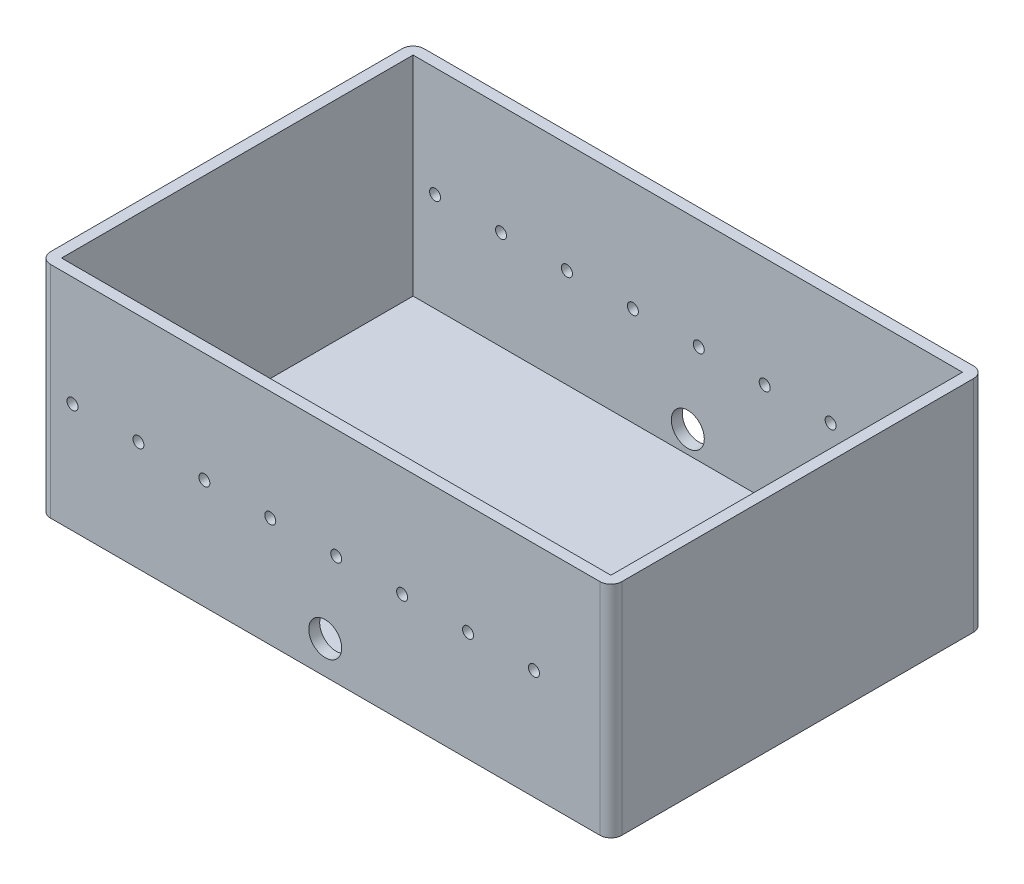
ISO-10303-21;
HEADER;
FILE_DESCRIPTION(('STEP AP214'),'2;1');
FILE_NAME('part.step','',(''),(''),'','','');
FILE_SCHEMA(('AUTOMOTIVE_DESIGN { 1 0 10303 214 1 1 1 1 }'));
ENDSEC;
DATA;
#1=APPLICATION_CONTEXT('core data for automotive mechanical design processes');
#2=APPLICATION_PROTOCOL_DEFINITION('international standard','automotive_design',2000,#1);
#3=PRODUCT_CONTEXT('',#1,'mechanical');
#4=PRODUCT('Part','Part','',(#3));
#5=PRODUCT_RELATED_PRODUCT_CATEGORY('part','',(#4));
#6=PRODUCT_DEFINITION_FORMATION('','',#4);
#7=PRODUCT_DEFINITION_CONTEXT('part definition',#1,'design');
#8=PRODUCT_DEFINITION('design','',#6,#7);
#9=PRODUCT_DEFINITION_SHAPE('','',#8);
#10=(LENGTH_UNIT() NAMED_UNIT(*) SI_UNIT(.MILLI.,.METRE.));
#11=(NAMED_UNIT(*) PLANE_ANGLE_UNIT() SI_UNIT($,.RADIAN.));
#12=(NAMED_UNIT(*) SI_UNIT($,.STERADIAN.) SOLID_ANGLE_UNIT());
#13=UNCERTAINTY_MEASURE_WITH_UNIT(LENGTH_MEASURE(1.E-05),#10,'distance_accuracy_value','');
#14=(GEOMETRIC_REPRESENTATION_CONTEXT(3) GLOBAL_UNCERTAINTY_ASSIGNED_CONTEXT((#13)) GLOBAL_UNIT_ASSIGNED_CONTEXT((#10,
#11,#12)) REPRESENTATION_CONTEXT('',''));
#15=CARTESIAN_POINT('',(0.,0.,0.));
#16=DIRECTION('',(0.,0.,1.));
#17=DIRECTION('',(1.,0.,0.));
#18=AXIS2_PLACEMENT_3D('',#15,#16,#17);
#19=CARTESIAN_POINT('',(130.,100.,0.));
#20=DIRECTION('',(0.,1.,0.));
#21=DIRECTION('',(0.,0.,1.));
#22=AXIS2_PLACEMENT_3D('',#19,#20,#21);
#23=PLANE('',#22);
#24=DIRECTION('',(-1.,0.,0.));
#25=VECTOR('',#24,1.);
#26=CARTESIAN_POINT('',(130.,100.,0.));
#27=LINE('',#26,#25);
#28=CARTESIAN_POINT('',(125.,100.,0.));
#29=VERTEX_POINT('',#28);
#30=CARTESIAN_POINT('',(-125.,100.,0.));
#31=VERTEX_POINT('',#30);
#32=EDGE_CURVE('E180',#29,#31,#27,.T.);
#33=ORIENTED_EDGE('',*,*,#32,.T.);
#34=CARTESIAN_POINT('',(-125.,100.,5.));
#35=DIRECTION('',(0.,1.,0.));
#36=DIRECTION('',(0.,0.,1.));
#37=AXIS2_PLACEMENT_3D('',#34,#35,#36);
#38=CIRCLE('',#37,5.);
#39=CARTESIAN_POINT('',(-130.,100.,5.));
#40=VERTEX_POINT('',#39);
#41=EDGE_CURVE('E220',#31,#40,#38,.T.);
#42=ORIENTED_EDGE('',*,*,#41,.T.);
#43=DIRECTION('',(0.,0.,-1.));
#44=VECTOR('',#43,1.);
#45=CARTESIAN_POINT('',(-130.,100.,0.));
#46=LINE('',#45,#44);
#47=CARTESIAN_POINT('',(-130.,100.,165.));
#48=VERTEX_POINT('',#47);
#49=EDGE_CURVE('E170',#48,#40,#46,.T.);
#50=ORIENTED_EDGE('',*,*,#49,.F.);
#51=CARTESIAN_POINT('',(-125.,100.,165.));
#52=DIRECTION('',(0.,1.,0.));
#53=DIRECTION('',(0.,0.,1.));
#54=AXIS2_PLACEMENT_3D('',#51,#52,#53);
#55=CIRCLE('',#54,5.);
#56=CARTESIAN_POINT('',(-125.,100.,170.));
#57=VERTEX_POINT('',#56);
#58=EDGE_CURVE('E216',#48,#57,#55,.T.);
#59=ORIENTED_EDGE('',*,*,#58,.T.);
#60=DIRECTION('',(-1.,0.,0.));
#61=VECTOR('',#60,1.);
#62=CARTESIAN_POINT('',(130.,100.,170.));
#63=LINE('',#62,#61);
#64=CARTESIAN_POINT('',(125.,100.,170.));
#65=VERTEX_POINT('',#64);
#66=EDGE_CURVE('E193',#65,#57,#63,.T.);
#67=ORIENTED_EDGE('',*,*,#66,.F.);
#68=CARTESIAN_POINT('',(125.,100.,165.));
#69=DIRECTION('',(0.,1.,0.));
#70=DIRECTION('',(0.,0.,1.));
#71=AXIS2_PLACEMENT_3D('',#68,#69,#70);
#72=CIRCLE('',#71,5.);
#73=CARTESIAN_POINT('',(130.,100.,165.));
#74=VERTEX_POINT('',#73);
#75=EDGE_CURVE('E62',#65,#74,#72,.T.);
#76=ORIENTED_EDGE('',*,*,#75,.T.);
#77=DIRECTION('',(0.,0.,-1.));
#78=VECTOR('',#77,1.);
#79=CARTESIAN_POINT('',(130.,100.,0.));
#80=LINE('',#79,#78);
#81=CARTESIAN_POINT('',(130.,100.,5.));
#82=VERTEX_POINT('',#81);
#83=EDGE_CURVE('E174',#74,#82,#80,.T.);
#84=ORIENTED_EDGE('',*,*,#83,.T.);
#85=CARTESIAN_POINT('',(125.,100.,5.));
#86=DIRECTION('',(0.,1.,0.));
#87=DIRECTION('',(0.,0.,1.));
#88=AXIS2_PLACEMENT_3D('',#85,#86,#87);
#89=CIRCLE('',#88,5.);
#90=EDGE_CURVE('E218',#82,#29,#89,.T.);
#91=ORIENTED_EDGE('',*,*,#90,.T.);
#92=EDGE_LOOP('',(#33,#42,#50,#59,#67,#76,#84,#91));
#93=FACE_BOUND('',#92,.T.);
#94=DIRECTION('',(1.,0.,0.));
#95=VECTOR('',#94,1.);
#96=CARTESIAN_POINT('',(-125.,100.,165.));
#97=LINE('',#96,#95);
#98=CARTESIAN_POINT('',(-125.,100.,165.));
#99=VERTEX_POINT('',#98);
#100=CARTESIAN_POINT('',(125.,100.,165.));
#101=VERTEX_POINT('',#100);
#102=EDGE_CURVE('E140',#99,#101,#97,.T.);
#103=ORIENTED_EDGE('',*,*,#102,.F.);
#104=DIRECTION('',(0.,0.,1.));
#105=VECTOR('',#104,1.);
#106=CARTESIAN_POINT('',(-125.,100.,0.));
#107=LINE('',#106,#105);
#108=CARTESIAN_POINT('',(-125.,100.,5.));
#109=VERTEX_POINT('',#108);
#110=EDGE_CURVE('E147',#109,#99,#107,.T.);
#111=ORIENTED_EDGE('',*,*,#110,.F.);
#112=DIRECTION('',(1.,0.,0.));
#113=VECTOR('',#112,1.);
#114=CARTESIAN_POINT('',(-125.,100.,5.));
#115=LINE('',#114,#113);
#116=CARTESIAN_POINT('',(125.,100.,5.));
#117=VERTEX_POINT('',#116);
#118=EDGE_CURVE('E130',#109,#117,#115,.T.);
#119=ORIENTED_EDGE('',*,*,#118,.T.);
#120=DIRECTION('',(0.,0.,1.));
#121=VECTOR('',#120,1.);
#122=CARTESIAN_POINT('',(125.,100.,0.));
#123=LINE('',#122,#121);
#124=EDGE_CURVE('E160',#117,#101,#123,.T.);
#125=ORIENTED_EDGE('',*,*,#124,.T.);
#126=EDGE_LOOP('',(#103,#111,#119,#125));
#127=FACE_BOUND('',#126,.T.);
#128=ADVANCED_FACE('F38',(#93,#127),#23,.T.);
#129=CARTESIAN_POINT('',(130.,0.,170.));
#130=DIRECTION('',(0.,0.,1.));
#131=DIRECTION('',(1.,0.,0.));
#132=AXIS2_PLACEMENT_3D('',#129,#130,#131);
#133=PLANE('',#132);
#134=CARTESIAN_POINT('',(0.,15.,170.));
#135=DIRECTION('',(0.,0.,1.));
#136=DIRECTION('',(1.,0.,0.));
#137=AXIS2_PLACEMENT_3D('',#134,#135,#136);
#138=CIRCLE('',#137,7.5);
#139=CARTESIAN_POINT('',(7.5,15.,170.));
#140=VERTEX_POINT('',#139);
#141=EDGE_CURVE('E327',#140,#140,#138,.T.);
#142=ORIENTED_EDGE('',*,*,#141,.F.);
#143=EDGE_LOOP('',(#142));
#144=FACE_BOUND('',#143,.T.);
#145=CARTESIAN_POINT('',(95.,50.,170.));
#146=DIRECTION('',(0.,0.,1.));
#147=DIRECTION('',(1.,0.,0.));
#148=AXIS2_PLACEMENT_3D('',#145,#146,#147);
#149=CIRCLE('',#148,2.5);
#150=CARTESIAN_POINT('',(97.5,50.,170.));
#151=VERTEX_POINT('',#150);
#152=EDGE_CURVE('E320',#151,#151,#149,.T.);
#153=ORIENTED_EDGE('',*,*,#152,.F.);
#154=EDGE_LOOP('',(#153));
#155=FACE_BOUND('',#154,.T.);
#156=CARTESIAN_POINT('',(65.,49.9999999999998,170.));
#157=DIRECTION('',(0.,0.,1.));
#158=DIRECTION('',(1.,0.,0.));
#159=AXIS2_PLACEMENT_3D('',#156,#157,#158);
#160=CIRCLE('',#159,2.5);
#161=CARTESIAN_POINT('',(67.5,49.9999999999998,170.));
#162=VERTEX_POINT('',#161);
#163=EDGE_CURVE('E314',#162,#162,#160,.T.);
#164=ORIENTED_EDGE('',*,*,#163,.F.);
#165=EDGE_LOOP('',(#164));
#166=FACE_BOUND('',#165,.T.);
#167=CARTESIAN_POINT('',(35.,49.9999999999996,170.));
#168=DIRECTION('',(0.,0.,1.));
#169=DIRECTION('',(1.,0.,0.));
#170=AXIS2_PLACEMENT_3D('',#167,#168,#169);
#171=CIRCLE('',#170,2.5);
#172=CARTESIAN_POINT('',(37.5,49.9999999999996,170.));
#173=VERTEX_POINT('',#172);
#174=EDGE_CURVE('E308',#173,#173,#171,.T.);
#175=ORIENTED_EDGE('',*,*,#174,.F.);
#176=EDGE_LOOP('',(#175));
#177=FACE_BOUND('',#176,.T.);
#178=CARTESIAN_POINT('',(5.,49.9999999999994,170.));
#179=DIRECTION('',(0.,0.,1.));
#180=DIRECTION('',(1.,0.,0.));
#181=AXIS2_PLACEMENT_3D('',#178,#179,#180);
#182=CIRCLE('',#181,2.5);
#183=CARTESIAN_POINT('',(7.5,49.9999999999994,170.));
#184=VERTEX_POINT('',#183);
#185=EDGE_CURVE('E302',#184,#184,#182,.T.);
#186=ORIENTED_EDGE('',*,*,#185,.F.);
#187=EDGE_LOOP('',(#186));
#188=FACE_BOUND('',#187,.T.);
#189=CARTESIAN_POINT('',(-25.,49.9999999999991,170.));
#190=DIRECTION('',(0.,0.,1.));
#191=DIRECTION('',(1.,0.,0.));
#192=AXIS2_PLACEMENT_3D('',#189,#190,#191);
#193=CIRCLE('',#192,2.5);
#194=CARTESIAN_POINT('',(-22.5,49.9999999999991,170.));
#195=VERTEX_POINT('',#194);
#196=EDGE_CURVE('E296',#195,#195,#193,.T.);
#197=ORIENTED_EDGE('',*,*,#196,.F.);
#198=EDGE_LOOP('',(#197));
#199=FACE_BOUND('',#198,.T.);
#200=CARTESIAN_POINT('',(-55.,49.9999999999989,170.));
#201=DIRECTION('',(0.,0.,1.));
#202=DIRECTION('',(1.,0.,0.));
#203=AXIS2_PLACEMENT_3D('',#200,#201,#202);
#204=CIRCLE('',#203,2.5);
#205=CARTESIAN_POINT('',(-52.5,49.9999999999989,170.));
#206=VERTEX_POINT('',#205);
#207=EDGE_CURVE('E290',#206,#206,#204,.T.);
#208=ORIENTED_EDGE('',*,*,#207,.F.);
#209=EDGE_LOOP('',(#208));
#210=FACE_BOUND('',#209,.T.);
#211=CARTESIAN_POINT('',(-85.,49.9999999999987,170.));
#212=DIRECTION('',(0.,0.,1.));
#213=DIRECTION('',(1.,0.,0.));
#214=AXIS2_PLACEMENT_3D('',#211,#212,#213);
#215=CIRCLE('',#214,2.5);
#216=CARTESIAN_POINT('',(-82.5,49.9999999999987,170.));
#217=VERTEX_POINT('',#216);
#218=EDGE_CURVE('E284',#217,#217,#215,.T.);
#219=ORIENTED_EDGE('',*,*,#218,.F.);
#220=EDGE_LOOP('',(#219));
#221=FACE_BOUND('',#220,.T.);
#222=CARTESIAN_POINT('',(-115.,49.9999999999985,170.));
#223=DIRECTION('',(0.,0.,1.));
#224=DIRECTION('',(1.,0.,0.));
#225=AXIS2_PLACEMENT_3D('',#222,#223,#224);
#226=CIRCLE('',#225,2.5);
#227=CARTESIAN_POINT('',(-112.5,49.9999999999985,170.));
#228=VERTEX_POINT('',#227);
#229=EDGE_CURVE('E277',#228,#228,#226,.T.);
#230=ORIENTED_EDGE('',*,*,#229,.F.);
#231=EDGE_LOOP('',(#230));
#232=FACE_BOUND('',#231,.T.);
#233=ORIENTED_EDGE('',*,*,#66,.T.);
#234=DIRECTION('',(0.,1.,0.));
#235=VECTOR('',#234,1.);
#236=CARTESIAN_POINT('',(-125.,0.,170.));
#237=LINE('',#236,#235);
#238=CARTESIAN_POINT('',(-125.,0.,170.));
#239=VERTEX_POINT('',#238);
#240=EDGE_CURVE('E11',#57,#239,#237,.F.);
#241=ORIENTED_EDGE('',*,*,#240,.T.);
#242=DIRECTION('',(-1.,0.,0.));
#243=VECTOR('',#242,1.);
#244=CARTESIAN_POINT('',(130.,0.,170.));
#245=LINE('',#244,#243);
#246=CARTESIAN_POINT('',(125.,0.,170.));
#247=VERTEX_POINT('',#246);
#248=EDGE_CURVE('E190',#247,#239,#245,.T.);
#249=ORIENTED_EDGE('',*,*,#248,.F.);
#250=DIRECTION('',(0.,1.,0.));
#251=VECTOR('',#250,1.);
#252=CARTESIAN_POINT('',(125.,0.,170.));
#253=LINE('',#252,#251);
#254=EDGE_CURVE('E47',#247,#65,#253,.T.);
#255=ORIENTED_EDGE('',*,*,#254,.T.);
#256=EDGE_LOOP('',(#233,#241,#249,#255));
#257=FACE_BOUND('',#256,.T.);
#258=ADVANCED_FACE('F355',(#144,#155,#166,#177,#188,#199,#210,#221,#232,#257),#133,.T.);
#259=CARTESIAN_POINT('',(130.,0.,0.));
#260=DIRECTION('',(0.,-1.,0.));
#261=DIRECTION('',(0.,0.,-1.));
#262=AXIS2_PLACEMENT_3D('',#259,#260,#261);
#263=PLANE('',#262);
#264=DIRECTION('',(0.,0.,1.));
#265=VECTOR('',#264,1.);
#266=CARTESIAN_POINT('',(-130.,0.,0.));
#267=LINE('',#266,#265);
#268=CARTESIAN_POINT('',(-130.,0.,5.));
#269=VERTEX_POINT('',#268);
#270=CARTESIAN_POINT('',(-130.,0.,165.));
#271=VERTEX_POINT('',#270);
#272=EDGE_CURVE('E177',#269,#271,#267,.T.);
#273=ORIENTED_EDGE('',*,*,#272,.F.);
#274=CARTESIAN_POINT('',(-125.,0.,5.));
#275=DIRECTION('',(0.,-1.,0.));
#276=DIRECTION('',(0.,0.,-1.));
#277=AXIS2_PLACEMENT_3D('',#274,#275,#276);
#278=CIRCLE('',#277,5.);
#279=CARTESIAN_POINT('',(-125.,0.,0.));
#280=VERTEX_POINT('',#279);
#281=EDGE_CURVE('E208',#269,#280,#278,.T.);
#282=ORIENTED_EDGE('',*,*,#281,.T.);
#283=DIRECTION('',(-1.,0.,0.));
#284=VECTOR('',#283,1.);
#285=CARTESIAN_POINT('',(130.,0.,0.));
#286=LINE('',#285,#284);
#287=CARTESIAN_POINT('',(125.,0.,0.));
#288=VERTEX_POINT('',#287);
#289=EDGE_CURVE('E187',#288,#280,#286,.T.);
#290=ORIENTED_EDGE('',*,*,#289,.F.);
#291=CARTESIAN_POINT('',(125.,0.,5.));
#292=DIRECTION('',(0.,-1.,0.));
#293=DIRECTION('',(0.,0.,-1.));
#294=AXIS2_PLACEMENT_3D('',#291,#292,#293);
#295=CIRCLE('',#294,5.);
#296=CARTESIAN_POINT('',(130.,0.,5.));
#297=VERTEX_POINT('',#296);
#298=EDGE_CURVE('E206',#288,#297,#295,.T.);
#299=ORIENTED_EDGE('',*,*,#298,.T.);
#300=DIRECTION('',(0.,0.,1.));
#301=VECTOR('',#300,1.);
#302=CARTESIAN_POINT('',(130.,0.,0.));
#303=LINE('',#302,#301);
#304=CARTESIAN_POINT('',(130.,0.,165.));
#305=VERTEX_POINT('',#304);
#306=EDGE_CURVE('E176',#297,#305,#303,.T.);
#307=ORIENTED_EDGE('',*,*,#306,.T.);
#308=CARTESIAN_POINT('',(125.,0.,165.));
#309=DIRECTION('',(0.,-1.,0.));
#310=DIRECTION('',(0.,0.,-1.));
#311=AXIS2_PLACEMENT_3D('',#308,#309,#310);
#312=CIRCLE('',#311,5.);
#313=EDGE_CURVE('E202',#305,#247,#312,.T.);
#314=ORIENTED_EDGE('',*,*,#313,.T.);
#315=ORIENTED_EDGE('',*,*,#248,.T.);
#316=CARTESIAN_POINT('',(-125.,0.,165.));
#317=DIRECTION('',(0.,-1.,0.));
#318=DIRECTION('',(0.,0.,-1.));
#319=AXIS2_PLACEMENT_3D('',#316,#317,#318);
#320=CIRCLE('',#319,5.);
#321=EDGE_CURVE('E204',#239,#271,#320,.T.);
#322=ORIENTED_EDGE('',*,*,#321,.T.);
#323=EDGE_LOOP('',(#273,#282,#290,#299,#307,#314,#315,#322));
#324=FACE_BOUND('',#323,.T.);
#325=ADVANCED_FACE('F360',(#324),#263,.T.);
#326=CARTESIAN_POINT('',(130.,0.,0.));
#327=DIRECTION('',(0.,0.,-1.));
#328=DIRECTION('',(-1.,0.,0.));
#329=AXIS2_PLACEMENT_3D('',#326,#327,#328);
#330=PLANE('',#329);
#331=CARTESIAN_POINT('',(0.,15.,0.));
#332=DIRECTION('',(0.,0.,1.));
#333=DIRECTION('',(1.,0.,0.));
#334=AXIS2_PLACEMENT_3D('',#331,#332,#333);
#335=CIRCLE('',#334,7.5);
#336=CARTESIAN_POINT('',(7.5,15.,0.));
#337=VERTEX_POINT('',#336);
#338=EDGE_CURVE('E330',#337,#337,#335,.T.);
#339=ORIENTED_EDGE('',*,*,#338,.T.);
#340=EDGE_LOOP('',(#339));
#341=FACE_BOUND('',#340,.T.);
#342=CARTESIAN_POINT('',(95.,50.,0.));
#343=DIRECTION('',(0.,0.,1.));
#344=DIRECTION('',(1.,0.,0.));
#345=AXIS2_PLACEMENT_3D('',#342,#343,#344);
#346=CIRCLE('',#345,2.5);
#347=CARTESIAN_POINT('',(97.5,50.,0.));
#348=VERTEX_POINT('',#347);
#349=EDGE_CURVE('E231',#348,#348,#346,.T.);
#350=ORIENTED_EDGE('',*,*,#349,.T.);
#351=EDGE_LOOP('',(#350));
#352=FACE_BOUND('',#351,.T.);
#353=CARTESIAN_POINT('',(65.,49.9999999999998,0.));
#354=DIRECTION('',(0.,0.,1.));
#355=DIRECTION('',(1.,0.,0.));
#356=AXIS2_PLACEMENT_3D('',#353,#354,#355);
#357=CIRCLE('',#356,2.5);
#358=CARTESIAN_POINT('',(67.5,49.9999999999998,0.));
#359=VERTEX_POINT('',#358);
#360=EDGE_CURVE('E317',#359,#359,#357,.T.);
#361=ORIENTED_EDGE('',*,*,#360,.T.);
#362=EDGE_LOOP('',(#361));
#363=FACE_BOUND('',#362,.T.);
#364=CARTESIAN_POINT('',(35.,49.9999999999996,0.));
#365=DIRECTION('',(0.,0.,1.));
#366=DIRECTION('',(1.,0.,0.));
#367=AXIS2_PLACEMENT_3D('',#364,#365,#366);
#368=CIRCLE('',#367,2.5);
#369=CARTESIAN_POINT('',(37.5,49.9999999999996,0.));
#370=VERTEX_POINT('',#369);
#371=EDGE_CURVE('E311',#370,#370,#368,.T.);
#372=ORIENTED_EDGE('',*,*,#371,.T.);
#373=EDGE_LOOP('',(#372));
#374=FACE_BOUND('',#373,.T.);
#375=CARTESIAN_POINT('',(5.,49.9999999999994,0.));
#376=DIRECTION('',(0.,0.,1.));
#377=DIRECTION('',(1.,0.,0.));
#378=AXIS2_PLACEMENT_3D('',#375,#376,#377);
#379=CIRCLE('',#378,2.5);
#380=CARTESIAN_POINT('',(7.5,49.9999999999994,0.));
#381=VERTEX_POINT('',#380);
#382=EDGE_CURVE('E305',#381,#381,#379,.T.);
#383=ORIENTED_EDGE('',*,*,#382,.T.);
#384=EDGE_LOOP('',(#383));
#385=FACE_BOUND('',#384,.T.);
#386=CARTESIAN_POINT('',(-25.,49.9999999999991,0.));
#387=DIRECTION('',(0.,0.,1.));
#388=DIRECTION('',(1.,0.,0.));
#389=AXIS2_PLACEMENT_3D('',#386,#387,#388);
#390=CIRCLE('',#389,2.5);
#391=CARTESIAN_POINT('',(-22.5,49.9999999999991,0.));
#392=VERTEX_POINT('',#391);
#393=EDGE_CURVE('E299',#392,#392,#390,.T.);
#394=ORIENTED_EDGE('',*,*,#393,.T.);
#395=EDGE_LOOP('',(#394));
#396=FACE_BOUND('',#395,.T.);
#397=CARTESIAN_POINT('',(-55.,49.9999999999989,0.));
#398=DIRECTION('',(0.,0.,1.));
#399=DIRECTION('',(1.,0.,0.));
#400=AXIS2_PLACEMENT_3D('',#397,#398,#399);
#401=CIRCLE('',#400,2.5);
#402=CARTESIAN_POINT('',(-52.5,49.9999999999989,0.));
#403=VERTEX_POINT('',#402);
#404=EDGE_CURVE('E293',#403,#403,#401,.T.);
#405=ORIENTED_EDGE('',*,*,#404,.T.);
#406=EDGE_LOOP('',(#405));
#407=FACE_BOUND('',#406,.T.);
#408=CARTESIAN_POINT('',(-85.,49.9999999999987,0.));
#409=DIRECTION('',(0.,0.,1.));
#410=DIRECTION('',(1.,0.,0.));
#411=AXIS2_PLACEMENT_3D('',#408,#409,#410);
#412=CIRCLE('',#411,2.5);
#413=CARTESIAN_POINT('',(-82.5,49.9999999999987,0.));
#414=VERTEX_POINT('',#413);
#415=EDGE_CURVE('E287',#414,#414,#412,.T.);
#416=ORIENTED_EDGE('',*,*,#415,.T.);
#417=EDGE_LOOP('',(#416));
#418=FACE_BOUND('',#417,.T.);
#419=CARTESIAN_POINT('',(-115.,49.9999999999985,0.));
#420=DIRECTION('',(0.,0.,1.));
#421=DIRECTION('',(1.,0.,0.));
#422=AXIS2_PLACEMENT_3D('',#419,#420,#421);
#423=CIRCLE('',#422,2.5);
#424=CARTESIAN_POINT('',(-112.5,49.9999999999985,0.));
#425=VERTEX_POINT('',#424);
#426=EDGE_CURVE('E280',#425,#425,#423,.T.);
#427=ORIENTED_EDGE('',*,*,#426,.T.);
#428=EDGE_LOOP('',(#427));
#429=FACE_BOUND('',#428,.T.);
#430=ORIENTED_EDGE('',*,*,#289,.T.);
#431=DIRECTION('',(0.,-1.,0.));
#432=VECTOR('',#431,1.);
#433=CARTESIAN_POINT('',(-125.,100.,0.));
#434=LINE('',#433,#432);
#435=EDGE_CURVE('E213',#280,#31,#434,.F.);
#436=ORIENTED_EDGE('',*,*,#435,.T.);
#437=ORIENTED_EDGE('',*,*,#32,.F.);
#438=DIRECTION('',(0.,-1.,0.));
#439=VECTOR('',#438,1.);
#440=CARTESIAN_POINT('',(125.,0.,0.));
#441=LINE('',#440,#439);
#442=EDGE_CURVE('E210',#29,#288,#441,.T.);
#443=ORIENTED_EDGE('',*,*,#442,.T.);
#444=EDGE_LOOP('',(#430,#436,#437,#443));
#445=FACE_BOUND('',#444,.T.);
#446=ADVANCED_FACE('F395',(#341,#352,#363,#374,#385,#396,#407,#418,#429,#445),#330,.T.);
#447=CARTESIAN_POINT('',(130.,0.,0.));
#448=DIRECTION('',(1.,0.,0.));
#449=DIRECTION('',(0.,0.,-1.));
#450=AXIS2_PLACEMENT_3D('',#447,#448,#449);
#451=PLANE('',#450);
#452=ORIENTED_EDGE('',*,*,#306,.F.);
#453=DIRECTION('',(0.,-1.,0.));
#454=VECTOR('',#453,1.);
#455=CARTESIAN_POINT('',(130.,0.,5.));
#456=LINE('',#455,#454);
#457=EDGE_CURVE('E55',#297,#82,#456,.F.);
#458=ORIENTED_EDGE('',*,*,#457,.T.);
#459=ORIENTED_EDGE('',*,*,#83,.F.);
#460=DIRECTION('',(0.,1.,0.));
#461=VECTOR('',#460,1.);
#462=CARTESIAN_POINT('',(130.,0.,165.));
#463=LINE('',#462,#461);
#464=EDGE_CURVE('E222',#74,#305,#463,.F.);
#465=ORIENTED_EDGE('',*,*,#464,.T.);
#466=EDGE_LOOP('',(#452,#458,#459,#465));
#467=FACE_BOUND('',#466,.T.);
#468=ADVANCED_FACE('F400',(#467),#451,.T.);
#469=CARTESIAN_POINT('',(-130.,0.,0.));
#470=DIRECTION('',(1.,0.,0.));
#471=DIRECTION('',(0.,0.,-1.));
#472=AXIS2_PLACEMENT_3D('',#469,#470,#471);
#473=PLANE('',#472);
#474=ORIENTED_EDGE('',*,*,#49,.T.);
#475=DIRECTION('',(0.,-1.,0.));
#476=VECTOR('',#475,1.);
#477=CARTESIAN_POINT('',(-130.,0.,5.));
#478=LINE('',#477,#476);
#479=EDGE_CURVE('E199',#40,#269,#478,.T.);
#480=ORIENTED_EDGE('',*,*,#479,.T.);
#481=ORIENTED_EDGE('',*,*,#272,.T.);
#482=DIRECTION('',(0.,1.,0.));
#483=VECTOR('',#482,1.);
#484=CARTESIAN_POINT('',(-130.,100.,165.));
#485=LINE('',#484,#483);
#486=EDGE_CURVE('E196',#271,#48,#485,.T.);
#487=ORIENTED_EDGE('',*,*,#486,.T.);
#488=EDGE_LOOP('',(#474,#480,#481,#487));
#489=FACE_BOUND('',#488,.T.);
#490=ADVANCED_FACE('F388',(#489),#473,.F.);
#491=CARTESIAN_POINT('',(-125.,0.,5.));
#492=DIRECTION('',(0.,0.,-1.));
#493=DIRECTION('',(-1.,0.,0.));
#494=AXIS2_PLACEMENT_3D('',#491,#492,#493);
#495=PLANE('',#494);
#496=CARTESIAN_POINT('',(0.,15.,5.));
#497=DIRECTION('',(0.,0.,-1.));
#498=DIRECTION('',(-1.,0.,0.));
#499=AXIS2_PLACEMENT_3D('',#496,#497,#498);
#500=CIRCLE('',#499,7.5);
#501=CARTESIAN_POINT('',(-7.5,15.,5.));
#502=VERTEX_POINT('',#501);
#503=EDGE_CURVE('E281',#502,#502,#500,.T.);
#504=ORIENTED_EDGE('',*,*,#503,.T.);
#505=EDGE_LOOP('',(#504));
#506=FACE_BOUND('',#505,.T.);
#507=CARTESIAN_POINT('',(95.,50.,5.));
#508=DIRECTION('',(0.,0.,-1.));
#509=DIRECTION('',(-1.,0.,0.));
#510=AXIS2_PLACEMENT_3D('',#507,#508,#509);
#511=CIRCLE('',#510,2.5);
#512=CARTESIAN_POINT('',(92.5,50.,5.));
#513=VERTEX_POINT('',#512);
#514=EDGE_CURVE('E161',#513,#513,#511,.T.);
#515=ORIENTED_EDGE('',*,*,#514,.T.);
#516=EDGE_LOOP('',(#515));
#517=FACE_BOUND('',#516,.T.);
#518=CARTESIAN_POINT('',(65.,49.9999999999998,5.));
#519=DIRECTION('',(0.,0.,-1.));
#520=DIRECTION('',(-1.,0.,0.));
#521=AXIS2_PLACEMENT_3D('',#518,#519,#520);
#522=CIRCLE('',#521,2.5);
#523=CARTESIAN_POINT('',(62.5,49.9999999999998,5.));
#524=VERTEX_POINT('',#523);
#525=EDGE_CURVE('E254',#524,#524,#522,.T.);
#526=ORIENTED_EDGE('',*,*,#525,.T.);
#527=EDGE_LOOP('',(#526));
#528=FACE_BOUND('',#527,.T.);
#529=CARTESIAN_POINT('',(35.,49.9999999999996,5.));
#530=DIRECTION('',(0.,0.,-1.));
#531=DIRECTION('',(-1.,0.,0.));
#532=AXIS2_PLACEMENT_3D('',#529,#530,#531);
#533=CIRCLE('',#532,2.5);
#534=CARTESIAN_POINT('',(32.5,49.9999999999996,5.));
#535=VERTEX_POINT('',#534);
#536=EDGE_CURVE('E251',#535,#535,#533,.T.);
#537=ORIENTED_EDGE('',*,*,#536,.T.);
#538=EDGE_LOOP('',(#537));
#539=FACE_BOUND('',#538,.T.);
#540=CARTESIAN_POINT('',(5.,49.9999999999994,5.));
#541=DIRECTION('',(0.,0.,-1.));
#542=DIRECTION('',(-1.,0.,0.));
#543=AXIS2_PLACEMENT_3D('',#540,#541,#542);
#544=CIRCLE('',#543,2.5);
#545=CARTESIAN_POINT('',(2.50000000000001,49.9999999999994,5.));
#546=VERTEX_POINT('',#545);
#547=EDGE_CURVE('E247',#546,#546,#544,.T.);
#548=ORIENTED_EDGE('',*,*,#547,.T.);
#549=EDGE_LOOP('',(#548));
#550=FACE_BOUND('',#549,.T.);
#551=CARTESIAN_POINT('',(-25.,49.9999999999991,5.));
#552=DIRECTION('',(0.,0.,-1.));
#553=DIRECTION('',(-1.,0.,0.));
#554=AXIS2_PLACEMENT_3D('',#551,#552,#553);
#555=CIRCLE('',#554,2.5);
#556=CARTESIAN_POINT('',(-27.5,49.9999999999991,5.));
#557=VERTEX_POINT('',#556);
#558=EDGE_CURVE('E243',#557,#557,#555,.T.);
#559=ORIENTED_EDGE('',*,*,#558,.T.);
#560=EDGE_LOOP('',(#559));
#561=FACE_BOUND('',#560,.T.);
#562=CARTESIAN_POINT('',(-55.,49.9999999999989,5.));
#563=DIRECTION('',(0.,0.,-1.));
#564=DIRECTION('',(-1.,0.,0.));
#565=AXIS2_PLACEMENT_3D('',#562,#563,#564);
#566=CIRCLE('',#565,2.5);
#567=CARTESIAN_POINT('',(-57.5,49.9999999999989,5.));
#568=VERTEX_POINT('',#567);
#569=EDGE_CURVE('E239',#568,#568,#566,.T.);
#570=ORIENTED_EDGE('',*,*,#569,.T.);
#571=EDGE_LOOP('',(#570));
#572=FACE_BOUND('',#571,.T.);
#573=CARTESIAN_POINT('',(-85.,49.9999999999987,5.));
#574=DIRECTION('',(0.,0.,-1.));
#575=DIRECTION('',(-1.,0.,0.));
#576=AXIS2_PLACEMENT_3D('',#573,#574,#575);
#577=CIRCLE('',#576,2.5);
#578=CARTESIAN_POINT('',(-87.5,49.9999999999987,5.));
#579=VERTEX_POINT('',#578);
#580=EDGE_CURVE('E235',#579,#579,#577,.T.);
#581=ORIENTED_EDGE('',*,*,#580,.T.);
#582=EDGE_LOOP('',(#581));
#583=FACE_BOUND('',#582,.T.);
#584=CARTESIAN_POINT('',(-115.,49.9999999999985,5.));
#585=DIRECTION('',(0.,0.,-1.));
#586=DIRECTION('',(-1.,0.,0.));
#587=AXIS2_PLACEMENT_3D('',#584,#585,#586);
#588=CIRCLE('',#587,2.5);
#589=CARTESIAN_POINT('',(-117.5,49.9999999999985,5.));
#590=VERTEX_POINT('',#589);
#591=EDGE_CURVE('E230',#590,#590,#588,.T.);
#592=ORIENTED_EDGE('',*,*,#591,.T.);
#593=EDGE_LOOP('',(#592));
#594=FACE_BOUND('',#593,.T.);
#595=DIRECTION('',(0.,1.,0.));
#596=VECTOR('',#595,1.);
#597=CARTESIAN_POINT('',(125.,0.,5.));
#598=LINE('',#597,#596);
#599=CARTESIAN_POINT('',(125.,4.99999999999998,5.));
#600=VERTEX_POINT('',#599);
#601=EDGE_CURVE('E136',#600,#117,#598,.T.);
#602=ORIENTED_EDGE('',*,*,#601,.T.);
#603=ORIENTED_EDGE('',*,*,#118,.F.);
#604=DIRECTION('',(0.,1.,0.));
#605=VECTOR('',#604,1.);
#606=CARTESIAN_POINT('',(-125.,0.,5.));
#607=LINE('',#606,#605);
#608=CARTESIAN_POINT('',(-125.,4.99999999999998,5.));
#609=VERTEX_POINT('',#608);
#610=EDGE_CURVE('E133',#609,#109,#607,.T.);
#611=ORIENTED_EDGE('',*,*,#610,.F.);
#612=DIRECTION('',(1.,0.,0.));
#613=VECTOR('',#612,1.);
#614=CARTESIAN_POINT('',(-125.,4.99999999999998,5.));
#615=LINE('',#614,#613);
#616=EDGE_CURVE('E168',#609,#600,#615,.T.);
#617=ORIENTED_EDGE('',*,*,#616,.T.);
#618=EDGE_LOOP('',(#602,#603,#611,#617));
#619=FACE_BOUND('',#618,.T.);
#620=ADVANCED_FACE('F132',(#506,#517,#528,#539,#550,#561,#572,#583,#594,#619),#495,.F.);
#621=CARTESIAN_POINT('',(-125.,4.99999999999998,0.));
#622=DIRECTION('',(0.,-1.,0.));
#623=DIRECTION('',(0.,0.,-1.));
#624=AXIS2_PLACEMENT_3D('',#621,#622,#623);
#625=PLANE('',#624);
#626=DIRECTION('',(0.,0.,-1.));
#627=VECTOR('',#626,1.);
#628=CARTESIAN_POINT('',(125.,4.99999999999998,0.));
#629=LINE('',#628,#627);
#630=CARTESIAN_POINT('',(125.,4.99999999999998,165.));
#631=VERTEX_POINT('',#630);
#632=EDGE_CURVE('E150',#631,#600,#629,.T.);
#633=ORIENTED_EDGE('',*,*,#632,.T.);
#634=ORIENTED_EDGE('',*,*,#616,.F.);
#635=DIRECTION('',(0.,0.,-1.));
#636=VECTOR('',#635,1.);
#637=CARTESIAN_POINT('',(-125.,4.99999999999998,0.));
#638=LINE('',#637,#636);
#639=CARTESIAN_POINT('',(-125.,4.99999999999998,165.));
#640=VERTEX_POINT('',#639);
#641=EDGE_CURVE('E141',#640,#609,#638,.T.);
#642=ORIENTED_EDGE('',*,*,#641,.F.);
#643=DIRECTION('',(1.,0.,0.));
#644=VECTOR('',#643,1.);
#645=CARTESIAN_POINT('',(-125.,4.99999999999998,165.));
#646=LINE('',#645,#644);
#647=EDGE_CURVE('E171',#640,#631,#646,.T.);
#648=ORIENTED_EDGE('',*,*,#647,.T.);
#649=EDGE_LOOP('',(#633,#634,#642,#648));
#650=FACE_BOUND('',#649,.T.);
#651=ADVANCED_FACE('F436',(#650),#625,.F.);
#652=CARTESIAN_POINT('',(-125.,0.,165.));
#653=DIRECTION('',(0.,0.,1.));
#654=DIRECTION('',(1.,0.,0.));
#655=AXIS2_PLACEMENT_3D('',#652,#653,#654);
#656=PLANE('',#655);
#657=CARTESIAN_POINT('',(0.,15.,165.));
#658=DIRECTION('',(0.,0.,1.));
#659=DIRECTION('',(1.,0.,0.));
#660=AXIS2_PLACEMENT_3D('',#657,#658,#659);
#661=CIRCLE('',#660,7.5);
#662=CARTESIAN_POINT('',(7.5,15.,165.));
#663=VERTEX_POINT('',#662);
#664=EDGE_CURVE('E42',#663,#663,#661,.T.);
#665=ORIENTED_EDGE('',*,*,#664,.T.);
#666=EDGE_LOOP('',(#665));
#667=FACE_BOUND('',#666,.T.);
#668=CARTESIAN_POINT('',(95.,50.,165.));
#669=DIRECTION('',(0.,0.,1.));
#670=DIRECTION('',(1.,0.,0.));
#671=AXIS2_PLACEMENT_3D('',#668,#669,#670);
#672=CIRCLE('',#671,2.5);
#673=CARTESIAN_POINT('',(97.5,50.,165.));
#674=VERTEX_POINT('',#673);
#675=EDGE_CURVE('E255',#674,#674,#672,.T.);
#676=ORIENTED_EDGE('',*,*,#675,.T.);
#677=EDGE_LOOP('',(#676));
#678=FACE_BOUND('',#677,.T.);
#679=CARTESIAN_POINT('',(65.,49.9999999999998,165.));
#680=DIRECTION('',(0.,0.,1.));
#681=DIRECTION('',(1.,0.,0.));
#682=AXIS2_PLACEMENT_3D('',#679,#680,#681);
#683=CIRCLE('',#682,2.5);
#684=CARTESIAN_POINT('',(67.5,49.9999999999998,165.));
#685=VERTEX_POINT('',#684);
#686=EDGE_CURVE('E252',#685,#685,#683,.T.);
#687=ORIENTED_EDGE('',*,*,#686,.T.);
#688=EDGE_LOOP('',(#687));
#689=FACE_BOUND('',#688,.T.);
#690=CARTESIAN_POINT('',(35.,49.9999999999996,165.));
#691=DIRECTION('',(0.,0.,1.));
#692=DIRECTION('',(1.,0.,0.));
#693=AXIS2_PLACEMENT_3D('',#690,#691,#692);
#694=CIRCLE('',#693,2.5);
#695=CARTESIAN_POINT('',(37.5,49.9999999999996,165.));
#696=VERTEX_POINT('',#695);
#697=EDGE_CURVE('E248',#696,#696,#694,.T.);
#698=ORIENTED_EDGE('',*,*,#697,.T.);
#699=EDGE_LOOP('',(#698));
#700=FACE_BOUND('',#699,.T.);
#701=CARTESIAN_POINT('',(5.,49.9999999999994,165.));
#702=DIRECTION('',(0.,0.,1.));
#703=DIRECTION('',(1.,0.,0.));
#704=AXIS2_PLACEMENT_3D('',#701,#702,#703);
#705=CIRCLE('',#704,2.5);
#706=CARTESIAN_POINT('',(7.5,49.9999999999994,165.));
#707=VERTEX_POINT('',#706);
#708=EDGE_CURVE('E244',#707,#707,#705,.T.);
#709=ORIENTED_EDGE('',*,*,#708,.T.);
#710=EDGE_LOOP('',(#709));
#711=FACE_BOUND('',#710,.T.);
#712=CARTESIAN_POINT('',(-25.,49.9999999999991,165.));
#713=DIRECTION('',(0.,0.,1.));
#714=DIRECTION('',(1.,0.,0.));
#715=AXIS2_PLACEMENT_3D('',#712,#713,#714);
#716=CIRCLE('',#715,2.5);
#717=CARTESIAN_POINT('',(-22.5,49.9999999999991,165.));
#718=VERTEX_POINT('',#717);
#719=EDGE_CURVE('E240',#718,#718,#716,.T.);
#720=ORIENTED_EDGE('',*,*,#719,.T.);
#721=EDGE_LOOP('',(#720));
#722=FACE_BOUND('',#721,.T.);
#723=CARTESIAN_POINT('',(-55.,49.9999999999989,165.));
#724=DIRECTION('',(0.,0.,1.));
#725=DIRECTION('',(1.,0.,0.));
#726=AXIS2_PLACEMENT_3D('',#723,#724,#725);
#727=CIRCLE('',#726,2.5);
#728=CARTESIAN_POINT('',(-52.5,49.9999999999989,165.));
#729=VERTEX_POINT('',#728);
#730=EDGE_CURVE('E236',#729,#729,#727,.T.);
#731=ORIENTED_EDGE('',*,*,#730,.T.);
#732=EDGE_LOOP('',(#731));
#733=FACE_BOUND('',#732,.T.);
#734=CARTESIAN_POINT('',(-85.,49.9999999999987,165.));
#735=DIRECTION('',(0.,0.,1.));
#736=DIRECTION('',(1.,0.,0.));
#737=AXIS2_PLACEMENT_3D('',#734,#735,#736);
#738=CIRCLE('',#737,2.5);
#739=CARTESIAN_POINT('',(-82.5,49.9999999999987,165.));
#740=VERTEX_POINT('',#739);
#741=EDGE_CURVE('E232',#740,#740,#738,.T.);
#742=ORIENTED_EDGE('',*,*,#741,.T.);
#743=EDGE_LOOP('',(#742));
#744=FACE_BOUND('',#743,.T.);
#745=CARTESIAN_POINT('',(-115.,49.9999999999985,165.));
#746=DIRECTION('',(0.,0.,1.));
#747=DIRECTION('',(1.,0.,0.));
#748=AXIS2_PLACEMENT_3D('',#745,#746,#747);
#749=CIRCLE('',#748,2.5);
#750=CARTESIAN_POINT('',(-112.5,49.9999999999985,165.));
#751=VERTEX_POINT('',#750);
#752=EDGE_CURVE('E227',#751,#751,#749,.T.);
#753=ORIENTED_EDGE('',*,*,#752,.T.);
#754=EDGE_LOOP('',(#753));
#755=FACE_BOUND('',#754,.T.);
#756=DIRECTION('',(0.,-1.,0.));
#757=VECTOR('',#756,1.);
#758=CARTESIAN_POINT('',(125.,0.,165.));
#759=LINE('',#758,#757);
#760=EDGE_CURVE('E163',#101,#631,#759,.T.);
#761=ORIENTED_EDGE('',*,*,#760,.T.);
#762=ORIENTED_EDGE('',*,*,#647,.F.);
#763=DIRECTION('',(0.,-1.,0.));
#764=VECTOR('',#763,1.);
#765=CARTESIAN_POINT('',(-125.,0.,165.));
#766=LINE('',#765,#764);
#767=EDGE_CURVE('E153',#99,#640,#766,.T.);
#768=ORIENTED_EDGE('',*,*,#767,.F.);
#769=ORIENTED_EDGE('',*,*,#102,.T.);
#770=EDGE_LOOP('',(#761,#762,#768,#769));
#771=FACE_BOUND('',#770,.T.);
#772=ADVANCED_FACE('F337',(#667,#678,#689,#700,#711,#722,#733,#744,#755,#771),#656,.F.);
#773=CARTESIAN_POINT('',(-125.,0.,0.));
#774=DIRECTION('',(1.,0.,0.));
#775=DIRECTION('',(0.,0.,-1.));
#776=AXIS2_PLACEMENT_3D('',#773,#774,#775);
#777=PLANE('',#776);
#778=ORIENTED_EDGE('',*,*,#610,.T.);
#779=ORIENTED_EDGE('',*,*,#110,.T.);
#780=ORIENTED_EDGE('',*,*,#767,.T.);
#781=ORIENTED_EDGE('',*,*,#641,.T.);
#782=EDGE_LOOP('',(#778,#779,#780,#781));
#783=FACE_BOUND('',#782,.T.);
#784=ADVANCED_FACE('F145',(#783),#777,.T.);
#785=CARTESIAN_POINT('',(125.,0.,0.));
#786=DIRECTION('',(1.,0.,0.));
#787=DIRECTION('',(0.,0.,-1.));
#788=AXIS2_PLACEMENT_3D('',#785,#786,#787);
#789=PLANE('',#788);
#790=ORIENTED_EDGE('',*,*,#601,.F.);
#791=ORIENTED_EDGE('',*,*,#632,.F.);
#792=ORIENTED_EDGE('',*,*,#760,.F.);
#793=ORIENTED_EDGE('',*,*,#124,.F.);
#794=EDGE_LOOP('',(#790,#791,#792,#793));
#795=FACE_BOUND('',#794,.T.);
#796=ADVANCED_FACE('F369',(#795),#789,.F.);
#797=CARTESIAN_POINT('',(-125.,0.,5.));
#798=DIRECTION('',(0.,1.,0.));
#799=DIRECTION('',(0.,0.,1.));
#800=AXIS2_PLACEMENT_3D('',#797,#798,#799);
#801=CYLINDRICAL_SURFACE('',#800,5.);
#802=ORIENTED_EDGE('',*,*,#41,.F.);
#803=ORIENTED_EDGE('',*,*,#435,.F.);
#804=ORIENTED_EDGE('',*,*,#281,.F.);
#805=ORIENTED_EDGE('',*,*,#479,.F.);
#806=EDGE_LOOP('',(#802,#803,#804,#805));
#807=FACE_BOUND('',#806,.T.);
#808=ADVANCED_FACE('F365',(#807),#801,.T.);
#809=CARTESIAN_POINT('',(125.,0.,5.));
#810=DIRECTION('',(0.,-1.,0.));
#811=DIRECTION('',(0.,0.,-1.));
#812=AXIS2_PLACEMENT_3D('',#809,#810,#811);
#813=CYLINDRICAL_SURFACE('',#812,5.);
#814=ORIENTED_EDGE('',*,*,#90,.F.);
#815=ORIENTED_EDGE('',*,*,#457,.F.);
#816=ORIENTED_EDGE('',*,*,#298,.F.);
#817=ORIENTED_EDGE('',*,*,#442,.F.);
#818=EDGE_LOOP('',(#814,#815,#816,#817));
#819=FACE_BOUND('',#818,.T.);
#820=ADVANCED_FACE('F368',(#819),#813,.T.);
#821=CARTESIAN_POINT('',(-125.,0.,165.));
#822=DIRECTION('',(0.,-1.,0.));
#823=DIRECTION('',(0.,0.,-1.));
#824=AXIS2_PLACEMENT_3D('',#821,#822,#823);
#825=CYLINDRICAL_SURFACE('',#824,5.);
#826=ORIENTED_EDGE('',*,*,#321,.F.);
#827=ORIENTED_EDGE('',*,*,#240,.F.);
#828=ORIENTED_EDGE('',*,*,#58,.F.);
#829=ORIENTED_EDGE('',*,*,#486,.F.);
#830=EDGE_LOOP('',(#826,#827,#828,#829));
#831=FACE_BOUND('',#830,.T.);
#832=ADVANCED_FACE('F372',(#831),#825,.T.);
#833=CARTESIAN_POINT('',(125.,0.,165.));
#834=DIRECTION('',(0.,1.,0.));
#835=DIRECTION('',(0.,0.,1.));
#836=AXIS2_PLACEMENT_3D('',#833,#834,#835);
#837=CYLINDRICAL_SURFACE('',#836,5.);
#838=ORIENTED_EDGE('',*,*,#313,.F.);
#839=ORIENTED_EDGE('',*,*,#464,.F.);
#840=ORIENTED_EDGE('',*,*,#75,.F.);
#841=ORIENTED_EDGE('',*,*,#254,.F.);
#842=EDGE_LOOP('',(#838,#839,#840,#841));
#843=FACE_BOUND('',#842,.T.);
#844=ADVANCED_FACE('F40',(#843),#837,.T.);
#845=CARTESIAN_POINT('',(-115.,49.9999999999985,0.));
#846=DIRECTION('',(0.,0.,1.));
#847=DIRECTION('',(1.,0.,0.));
#848=AXIS2_PLACEMENT_3D('',#845,#846,#847);
#849=CYLINDRICAL_SURFACE('',#848,2.5);
#850=ORIENTED_EDGE('',*,*,#229,.T.);
#851=EDGE_LOOP('',(#850));
#852=FACE_BOUND('',#851,.T.);
#853=ORIENTED_EDGE('',*,*,#752,.F.);
#854=EDGE_LOOP('',(#853));
#855=FACE_BOUND('',#854,.T.);
#856=ADVANCED_FACE('F379',(#852,#855),#849,.F.);
#857=CARTESIAN_POINT('',(-85.,49.9999999999987,0.));
#858=DIRECTION('',(0.,0.,1.));
#859=DIRECTION('',(1.,0.,0.));
#860=AXIS2_PLACEMENT_3D('',#857,#858,#859);
#861=CYLINDRICAL_SURFACE('',#860,2.5);
#862=ORIENTED_EDGE('',*,*,#218,.T.);
#863=EDGE_LOOP('',(#862));
#864=FACE_BOUND('',#863,.T.);
#865=ORIENTED_EDGE('',*,*,#741,.F.);
#866=EDGE_LOOP('',(#865));
#867=FACE_BOUND('',#866,.T.);
#868=ADVANCED_FACE('F525',(#864,#867),#861,.F.);
#869=CARTESIAN_POINT('',(-55.,49.9999999999989,0.));
#870=DIRECTION('',(0.,0.,1.));
#871=DIRECTION('',(1.,0.,0.));
#872=AXIS2_PLACEMENT_3D('',#869,#870,#871);
#873=CYLINDRICAL_SURFACE('',#872,2.5);
#874=ORIENTED_EDGE('',*,*,#207,.T.);
#875=EDGE_LOOP('',(#874));
#876=FACE_BOUND('',#875,.T.);
#877=ORIENTED_EDGE('',*,*,#730,.F.);
#878=EDGE_LOOP('',(#877));
#879=FACE_BOUND('',#878,.T.);
#880=ADVANCED_FACE('F515',(#876,#879),#873,.F.);
#881=CARTESIAN_POINT('',(-25.,49.9999999999991,0.));
#882=DIRECTION('',(0.,0.,1.));
#883=DIRECTION('',(1.,0.,0.));
#884=AXIS2_PLACEMENT_3D('',#881,#882,#883);
#885=CYLINDRICAL_SURFACE('',#884,2.5);
#886=ORIENTED_EDGE('',*,*,#196,.T.);
#887=EDGE_LOOP('',(#886));
#888=FACE_BOUND('',#887,.T.);
#889=ORIENTED_EDGE('',*,*,#719,.F.);
#890=EDGE_LOOP('',(#889));
#891=FACE_BOUND('',#890,.T.);
#892=ADVANCED_FACE('F505',(#888,#891),#885,.F.);
#893=CARTESIAN_POINT('',(5.,49.9999999999994,0.));
#894=DIRECTION('',(0.,0.,1.));
#895=DIRECTION('',(1.,0.,0.));
#896=AXIS2_PLACEMENT_3D('',#893,#894,#895);
#897=CYLINDRICAL_SURFACE('',#896,2.5);
#898=ORIENTED_EDGE('',*,*,#185,.T.);
#899=EDGE_LOOP('',(#898));
#900=FACE_BOUND('',#899,.T.);
#901=ORIENTED_EDGE('',*,*,#708,.F.);
#902=EDGE_LOOP('',(#901));
#903=FACE_BOUND('',#902,.T.);
#904=ADVANCED_FACE('F495',(#900,#903),#897,.F.);
#905=CARTESIAN_POINT('',(35.,49.9999999999996,0.));
#906=DIRECTION('',(0.,0.,1.));
#907=DIRECTION('',(1.,0.,0.));
#908=AXIS2_PLACEMENT_3D('',#905,#906,#907);
#909=CYLINDRICAL_SURFACE('',#908,2.5);
#910=ORIENTED_EDGE('',*,*,#174,.T.);
#911=EDGE_LOOP('',(#910));
#912=FACE_BOUND('',#911,.T.);
#913=ORIENTED_EDGE('',*,*,#697,.F.);
#914=EDGE_LOOP('',(#913));
#915=FACE_BOUND('',#914,.T.);
#916=ADVANCED_FACE('F485',(#912,#915),#909,.F.);
#917=CARTESIAN_POINT('',(65.,49.9999999999998,0.));
#918=DIRECTION('',(0.,0.,1.));
#919=DIRECTION('',(1.,0.,0.));
#920=AXIS2_PLACEMENT_3D('',#917,#918,#919);
#921=CYLINDRICAL_SURFACE('',#920,2.5);
#922=ORIENTED_EDGE('',*,*,#163,.T.);
#923=EDGE_LOOP('',(#922));
#924=FACE_BOUND('',#923,.T.);
#925=ORIENTED_EDGE('',*,*,#686,.F.);
#926=EDGE_LOOP('',(#925));
#927=FACE_BOUND('',#926,.T.);
#928=ADVANCED_FACE('F475',(#924,#927),#921,.F.);
#929=CARTESIAN_POINT('',(95.,50.,0.));
#930=DIRECTION('',(0.,0.,1.));
#931=DIRECTION('',(1.,0.,0.));
#932=AXIS2_PLACEMENT_3D('',#929,#930,#931);
#933=CYLINDRICAL_SURFACE('',#932,2.5);
#934=ORIENTED_EDGE('',*,*,#152,.T.);
#935=EDGE_LOOP('',(#934));
#936=FACE_BOUND('',#935,.T.);
#937=ORIENTED_EDGE('',*,*,#675,.F.);
#938=EDGE_LOOP('',(#937));
#939=FACE_BOUND('',#938,.T.);
#940=ADVANCED_FACE('F353',(#936,#939),#933,.F.);
#941=ORIENTED_EDGE('',*,*,#426,.F.);
#942=EDGE_LOOP('',(#941));
#943=FACE_BOUND('',#942,.T.);
#944=ORIENTED_EDGE('',*,*,#591,.F.);
#945=EDGE_LOOP('',(#944));
#946=FACE_BOUND('',#945,.T.);
#947=ADVANCED_FACE('F522',(#943,#946),#849,.F.);
#948=ORIENTED_EDGE('',*,*,#415,.F.);
#949=EDGE_LOOP('',(#948));
#950=FACE_BOUND('',#949,.T.);
#951=ORIENTED_EDGE('',*,*,#580,.F.);
#952=EDGE_LOOP('',(#951));
#953=FACE_BOUND('',#952,.T.);
#954=ADVANCED_FACE('F512',(#950,#953),#861,.F.);
#955=ORIENTED_EDGE('',*,*,#404,.F.);
#956=EDGE_LOOP('',(#955));
#957=FACE_BOUND('',#956,.T.);
#958=ORIENTED_EDGE('',*,*,#569,.F.);
#959=EDGE_LOOP('',(#958));
#960=FACE_BOUND('',#959,.T.);
#961=ADVANCED_FACE('F502',(#957,#960),#873,.F.);
#962=ORIENTED_EDGE('',*,*,#393,.F.);
#963=EDGE_LOOP('',(#962));
#964=FACE_BOUND('',#963,.T.);
#965=ORIENTED_EDGE('',*,*,#558,.F.);
#966=EDGE_LOOP('',(#965));
#967=FACE_BOUND('',#966,.T.);
#968=ADVANCED_FACE('F492',(#964,#967),#885,.F.);
#969=ORIENTED_EDGE('',*,*,#382,.F.);
#970=EDGE_LOOP('',(#969));
#971=FACE_BOUND('',#970,.T.);
#972=ORIENTED_EDGE('',*,*,#547,.F.);
#973=EDGE_LOOP('',(#972));
#974=FACE_BOUND('',#973,.T.);
#975=ADVANCED_FACE('F482',(#971,#974),#897,.F.);
#976=ORIENTED_EDGE('',*,*,#371,.F.);
#977=EDGE_LOOP('',(#976));
#978=FACE_BOUND('',#977,.T.);
#979=ORIENTED_EDGE('',*,*,#536,.F.);
#980=EDGE_LOOP('',(#979));
#981=FACE_BOUND('',#980,.T.);
#982=ADVANCED_FACE('F472',(#978,#981),#909,.F.);
#983=ORIENTED_EDGE('',*,*,#360,.F.);
#984=EDGE_LOOP('',(#983));
#985=FACE_BOUND('',#984,.T.);
#986=ORIENTED_EDGE('',*,*,#525,.F.);
#987=EDGE_LOOP('',(#986));
#988=FACE_BOUND('',#987,.T.);
#989=ADVANCED_FACE('F350',(#985,#988),#921,.F.);
#990=ORIENTED_EDGE('',*,*,#349,.F.);
#991=EDGE_LOOP('',(#990));
#992=FACE_BOUND('',#991,.T.);
#993=ORIENTED_EDGE('',*,*,#514,.F.);
#994=EDGE_LOOP('',(#993));
#995=FACE_BOUND('',#994,.T.);
#996=ADVANCED_FACE('F342',(#992,#995),#933,.F.);
#997=CARTESIAN_POINT('',(0.,15.,0.));
#998=DIRECTION('',(0.,0.,1.));
#999=DIRECTION('',(1.,0.,0.));
#1000=AXIS2_PLACEMENT_3D('',#997,#998,#999);
#1001=CYLINDRICAL_SURFACE('',#1000,7.5);
#1002=ORIENTED_EDGE('',*,*,#141,.T.);
#1003=EDGE_LOOP('',(#1002));
#1004=FACE_BOUND('',#1003,.T.);
#1005=ORIENTED_EDGE('',*,*,#664,.F.);
#1006=EDGE_LOOP('',(#1005));
#1007=FACE_BOUND('',#1006,.T.);
#1008=ADVANCED_FACE('F339',(#1004,#1007),#1001,.F.);
#1009=ORIENTED_EDGE('',*,*,#338,.F.);
#1010=EDGE_LOOP('',(#1009));
#1011=FACE_BOUND('',#1010,.T.);
#1012=ORIENTED_EDGE('',*,*,#503,.F.);
#1013=EDGE_LOOP('',(#1012));
#1014=FACE_BOUND('',#1013,.T.);
#1015=ADVANCED_FACE('F341',(#1011,#1014),#1001,.F.);
#1016=CLOSED_SHELL('',(#128,#258,#325,#446,#468,#490,#620,#651,#772,#784,#796,#808,#820,#832,
#844,#856,#868,#880,#892,#904,#916,#928,#940,#947,#954,#961,#968,#975,#982,#989,#996,#1008,#1015));
#1017=MANIFOLD_SOLID_BREP('B2',#1016);
#1018=ADVANCED_BREP_SHAPE_REPRESENTATION('',(#18,#1017),#14);
#1019=SHAPE_DEFINITION_REPRESENTATION(#9,#1018);
ENDSEC;
END-ISO-10303-21;
